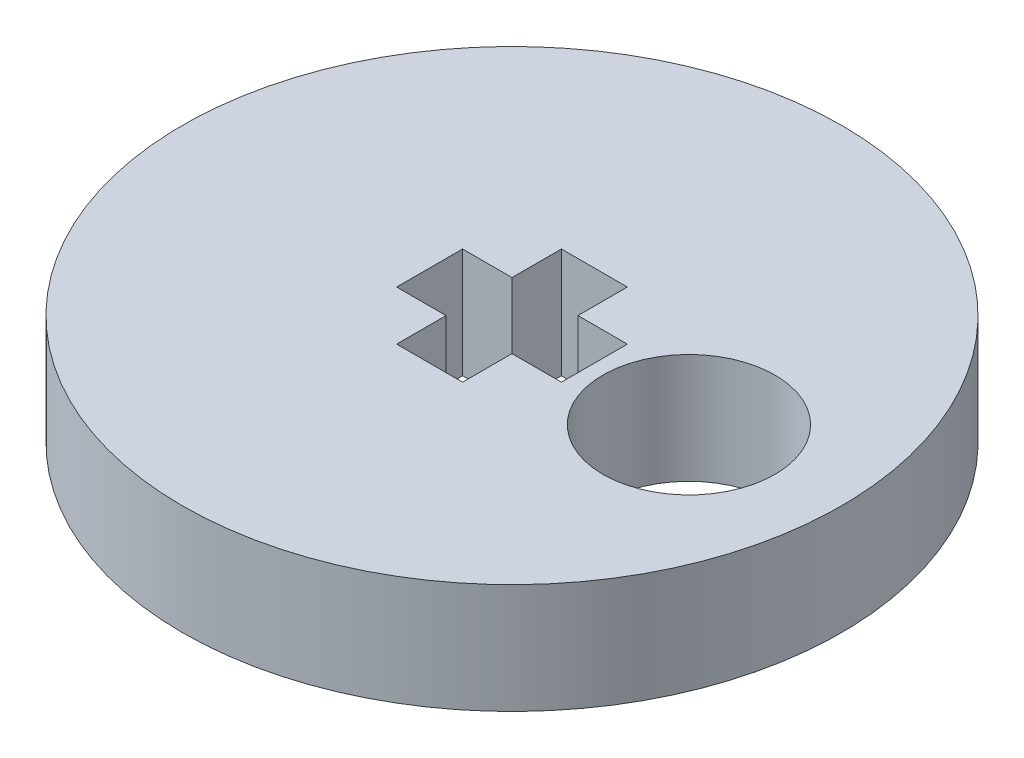
ISO-10303-21;
HEADER;
FILE_DESCRIPTION(('STEP AP214'),'2;1');
FILE_NAME('part.step','',(''),(''),'','','');
FILE_SCHEMA(('AUTOMOTIVE_DESIGN { 1 0 10303 214 1 1 1 1 }'));
ENDSEC;
DATA;
#1=APPLICATION_CONTEXT('core data for automotive mechanical design processes');
#2=APPLICATION_PROTOCOL_DEFINITION('international standard','automotive_design',2000,#1);
#3=PRODUCT_CONTEXT('',#1,'mechanical');
#4=PRODUCT('Part','Part','',(#3));
#5=PRODUCT_RELATED_PRODUCT_CATEGORY('part','',(#4));
#6=PRODUCT_DEFINITION_FORMATION('','',#4);
#7=PRODUCT_DEFINITION_CONTEXT('part definition',#1,'design');
#8=PRODUCT_DEFINITION('design','',#6,#7);
#9=PRODUCT_DEFINITION_SHAPE('','',#8);
#10=(LENGTH_UNIT() NAMED_UNIT(*) SI_UNIT(.MILLI.,.METRE.));
#11=(NAMED_UNIT(*) PLANE_ANGLE_UNIT() SI_UNIT($,.RADIAN.));
#12=(NAMED_UNIT(*) SI_UNIT($,.STERADIAN.) SOLID_ANGLE_UNIT());
#13=UNCERTAINTY_MEASURE_WITH_UNIT(LENGTH_MEASURE(1.E-05),#10,'distance_accuracy_value','');
#14=(GEOMETRIC_REPRESENTATION_CONTEXT(3) GLOBAL_UNCERTAINTY_ASSIGNED_CONTEXT((#13)) GLOBAL_UNIT_ASSIGNED_CONTEXT((#10,
#11,#12)) REPRESENTATION_CONTEXT('',''));
#15=CARTESIAN_POINT('',(0.,0.,0.));
#16=DIRECTION('',(0.,0.,1.));
#17=DIRECTION('',(1.,0.,0.));
#18=AXIS2_PLACEMENT_3D('',#15,#16,#17);
#19=CARTESIAN_POINT('',(0.,3.,0.));
#20=DIRECTION('',(0.,1.,0.));
#21=DIRECTION('',(0.,0.,1.));
#22=AXIS2_PLACEMENT_3D('',#19,#20,#21);
#23=PLANE('',#22);
#24=DIRECTION('',(0.,0.,1.));
#25=VECTOR('',#24,1.);
#26=CARTESIAN_POINT('',(-2.25,3.,-0.9));
#27=LINE('',#26,#25);
#28=CARTESIAN_POINT('',(-2.25,3.,-0.9));
#29=VERTEX_POINT('',#28);
#30=CARTESIAN_POINT('',(-2.25,3.,0.9));
#31=VERTEX_POINT('',#30);
#32=EDGE_CURVE('E144',#29,#31,#27,.T.);
#33=ORIENTED_EDGE('',*,*,#32,.F.);
#34=DIRECTION('',(-1.,0.,0.));
#35=VECTOR('',#34,1.);
#36=CARTESIAN_POINT('',(-0.9,3.,-0.9));
#37=LINE('',#36,#35);
#38=CARTESIAN_POINT('',(-0.9,3.,-0.9));
#39=VERTEX_POINT('',#38);
#40=EDGE_CURVE('E135',#39,#29,#37,.T.);
#41=ORIENTED_EDGE('',*,*,#40,.F.);
#42=DIRECTION('',(0.,0.,1.));
#43=VECTOR('',#42,1.);
#44=CARTESIAN_POINT('',(-0.900000000000001,3.,-2.25));
#45=LINE('',#44,#43);
#46=CARTESIAN_POINT('',(-0.900000000000001,3.,-2.25));
#47=VERTEX_POINT('',#46);
#48=EDGE_CURVE('E189',#47,#39,#45,.T.);
#49=ORIENTED_EDGE('',*,*,#48,.F.);
#50=DIRECTION('',(-1.,0.,0.));
#51=VECTOR('',#50,1.);
#52=CARTESIAN_POINT('',(0.9,3.,-2.25));
#53=LINE('',#52,#51);
#54=CARTESIAN_POINT('',(0.9,3.,-2.25));
#55=VERTEX_POINT('',#54);
#56=EDGE_CURVE('E186',#55,#47,#53,.T.);
#57=ORIENTED_EDGE('',*,*,#56,.F.);
#58=DIRECTION('',(0.,0.,-1.));
#59=VECTOR('',#58,1.);
#60=CARTESIAN_POINT('',(0.9,3.,-0.9));
#61=LINE('',#60,#59);
#62=CARTESIAN_POINT('',(0.9,3.,-0.9));
#63=VERTEX_POINT('',#62);
#64=EDGE_CURVE('E183',#63,#55,#61,.T.);
#65=ORIENTED_EDGE('',*,*,#64,.F.);
#66=DIRECTION('',(-1.,0.,0.));
#67=VECTOR('',#66,1.);
#68=CARTESIAN_POINT('',(2.25,3.,-0.9));
#69=LINE('',#68,#67);
#70=CARTESIAN_POINT('',(2.25,3.,-0.9));
#71=VERTEX_POINT('',#70);
#72=EDGE_CURVE('E180',#71,#63,#69,.T.);
#73=ORIENTED_EDGE('',*,*,#72,.F.);
#74=DIRECTION('',(0.,0.,-1.));
#75=VECTOR('',#74,1.);
#76=CARTESIAN_POINT('',(2.25,3.,0.9));
#77=LINE('',#76,#75);
#78=CARTESIAN_POINT('',(2.25,3.,0.9));
#79=VERTEX_POINT('',#78);
#80=EDGE_CURVE('E177',#79,#71,#77,.T.);
#81=ORIENTED_EDGE('',*,*,#80,.F.);
#82=DIRECTION('',(1.,0.,0.));
#83=VECTOR('',#82,1.);
#84=CARTESIAN_POINT('',(0.9,3.,0.9));
#85=LINE('',#84,#83);
#86=CARTESIAN_POINT('',(0.9,3.,0.9));
#87=VERTEX_POINT('',#86);
#88=EDGE_CURVE('E174',#87,#79,#85,.T.);
#89=ORIENTED_EDGE('',*,*,#88,.F.);
#90=DIRECTION('',(0.,0.,-1.));
#91=VECTOR('',#90,1.);
#92=CARTESIAN_POINT('',(0.9,3.,2.25));
#93=LINE('',#92,#91);
#94=CARTESIAN_POINT('',(0.9,3.,2.25));
#95=VERTEX_POINT('',#94);
#96=EDGE_CURVE('E171',#95,#87,#93,.T.);
#97=ORIENTED_EDGE('',*,*,#96,.F.);
#98=DIRECTION('',(1.,0.,0.));
#99=VECTOR('',#98,1.);
#100=CARTESIAN_POINT('',(-0.899999999999999,3.,2.25));
#101=LINE('',#100,#99);
#102=CARTESIAN_POINT('',(-0.899999999999999,3.,2.25));
#103=VERTEX_POINT('',#102);
#104=EDGE_CURVE('E168',#103,#95,#101,.T.);
#105=ORIENTED_EDGE('',*,*,#104,.F.);
#106=DIRECTION('',(0.,0.,1.));
#107=VECTOR('',#106,1.);
#108=CARTESIAN_POINT('',(-0.9,3.,0.9));
#109=LINE('',#108,#107);
#110=CARTESIAN_POINT('',(-0.9,3.,0.9));
#111=VERTEX_POINT('',#110);
#112=EDGE_CURVE('E162',#111,#103,#109,.T.);
#113=ORIENTED_EDGE('',*,*,#112,.F.);
#114=DIRECTION('',(1.,0.,0.));
#115=VECTOR('',#114,1.);
#116=CARTESIAN_POINT('',(-2.25,3.,0.9));
#117=LINE('',#116,#115);
#118=EDGE_CURVE('E158',#31,#111,#117,.T.);
#119=ORIENTED_EDGE('',*,*,#118,.F.);
#120=EDGE_LOOP('',(#33,#41,#49,#57,#65,#73,#81,#89,#97,#105,#113,#119));
#121=FACE_BOUND('',#120,.T.);
#122=CARTESIAN_POINT('',(0.,3.,0.));
#123=DIRECTION('',(0.,1.,0.));
#124=DIRECTION('',(0.,0.,1.));
#125=AXIS2_PLACEMENT_3D('',#122,#123,#124);
#126=CIRCLE('',#125,9.);
#127=CARTESIAN_POINT('',(0.,3.,9.));
#128=VERTEX_POINT('',#127);
#129=EDGE_CURVE('E11',#128,#128,#126,.T.);
#130=ORIENTED_EDGE('',*,*,#129,.T.);
#131=EDGE_LOOP('',(#130));
#132=FACE_BOUND('',#131,.T.);
#133=CARTESIAN_POINT('',(4.99728198946741,3.,0.16484149278824));
#134=DIRECTION('',(0.,1.,0.));
#135=DIRECTION('',(0.,0.,1.));
#136=AXIS2_PLACEMENT_3D('',#133,#134,#135);
#137=CIRCLE('',#136,2.35);
#138=CARTESIAN_POINT('',(4.99728198946741,3.,2.51484149278824));
#139=VERTEX_POINT('',#138);
#140=EDGE_CURVE('E194',#139,#139,#137,.T.);
#141=ORIENTED_EDGE('',*,*,#140,.F.);
#142=EDGE_LOOP('',(#141));
#143=FACE_BOUND('',#142,.T.);
#144=ADVANCED_FACE('F45',(#121,#132,#143),#23,.T.);
#145=CARTESIAN_POINT('',(0.,0.,0.));
#146=DIRECTION('',(0.,1.,0.));
#147=DIRECTION('',(0.,0.,1.));
#148=AXIS2_PLACEMENT_3D('',#145,#146,#147);
#149=PLANE('',#148);
#150=CARTESIAN_POINT('',(0.,0.,0.));
#151=DIRECTION('',(0.,1.,0.));
#152=DIRECTION('',(0.,0.,1.));
#153=AXIS2_PLACEMENT_3D('',#150,#151,#152);
#154=CIRCLE('',#153,9.);
#155=CARTESIAN_POINT('',(0.,0.,9.));
#156=VERTEX_POINT('',#155);
#157=EDGE_CURVE('E49',#156,#156,#154,.T.);
#158=ORIENTED_EDGE('',*,*,#157,.F.);
#159=EDGE_LOOP('',(#158));
#160=FACE_BOUND('',#159,.T.);
#161=DIRECTION('',(-1.,0.,0.));
#162=VECTOR('',#161,1.);
#163=CARTESIAN_POINT('',(-0.9,0.,-0.9));
#164=LINE('',#163,#162);
#165=CARTESIAN_POINT('',(-0.9,0.,-0.9));
#166=VERTEX_POINT('',#165);
#167=CARTESIAN_POINT('',(-2.25,0.,-0.9));
#168=VERTEX_POINT('',#167);
#169=EDGE_CURVE('E69',#166,#168,#164,.T.);
#170=ORIENTED_EDGE('',*,*,#169,.T.);
#171=DIRECTION('',(0.,0.,1.));
#172=VECTOR('',#171,1.);
#173=CARTESIAN_POINT('',(-2.25,0.,-0.9));
#174=LINE('',#173,#172);
#175=CARTESIAN_POINT('',(-2.25,0.,0.9));
#176=VERTEX_POINT('',#175);
#177=EDGE_CURVE('E151',#168,#176,#174,.T.);
#178=ORIENTED_EDGE('',*,*,#177,.T.);
#179=DIRECTION('',(1.,0.,0.));
#180=VECTOR('',#179,1.);
#181=CARTESIAN_POINT('',(-2.25,0.,0.9));
#182=LINE('',#181,#180);
#183=CARTESIAN_POINT('',(-0.9,0.,0.9));
#184=VERTEX_POINT('',#183);
#185=EDGE_CURVE('E197',#176,#184,#182,.T.);
#186=ORIENTED_EDGE('',*,*,#185,.T.);
#187=DIRECTION('',(0.,0.,1.));
#188=VECTOR('',#187,1.);
#189=CARTESIAN_POINT('',(-0.9,0.,0.9));
#190=LINE('',#189,#188);
#191=CARTESIAN_POINT('',(-0.899999999999999,0.,2.25));
#192=VERTEX_POINT('',#191);
#193=EDGE_CURVE('E201',#184,#192,#190,.T.);
#194=ORIENTED_EDGE('',*,*,#193,.T.);
#195=DIRECTION('',(1.,0.,0.));
#196=VECTOR('',#195,1.);
#197=CARTESIAN_POINT('',(-0.899999999999999,0.,2.25));
#198=LINE('',#197,#196);
#199=CARTESIAN_POINT('',(0.9,0.,2.25));
#200=VERTEX_POINT('',#199);
#201=EDGE_CURVE('E205',#192,#200,#198,.T.);
#202=ORIENTED_EDGE('',*,*,#201,.T.);
#203=DIRECTION('',(0.,0.,-1.));
#204=VECTOR('',#203,1.);
#205=CARTESIAN_POINT('',(0.9,0.,2.25));
#206=LINE('',#205,#204);
#207=CARTESIAN_POINT('',(0.9,0.,0.9));
#208=VERTEX_POINT('',#207);
#209=EDGE_CURVE('E209',#200,#208,#206,.T.);
#210=ORIENTED_EDGE('',*,*,#209,.T.);
#211=DIRECTION('',(1.,0.,0.));
#212=VECTOR('',#211,1.);
#213=CARTESIAN_POINT('',(0.9,0.,0.9));
#214=LINE('',#213,#212);
#215=CARTESIAN_POINT('',(2.25,0.,0.9));
#216=VERTEX_POINT('',#215);
#217=EDGE_CURVE('E213',#208,#216,#214,.T.);
#218=ORIENTED_EDGE('',*,*,#217,.T.);
#219=DIRECTION('',(0.,0.,-1.));
#220=VECTOR('',#219,1.);
#221=CARTESIAN_POINT('',(2.25,0.,0.9));
#222=LINE('',#221,#220);
#223=CARTESIAN_POINT('',(2.25,0.,-0.9));
#224=VERTEX_POINT('',#223);
#225=EDGE_CURVE('E217',#216,#224,#222,.T.);
#226=ORIENTED_EDGE('',*,*,#225,.T.);
#227=DIRECTION('',(-1.,0.,0.));
#228=VECTOR('',#227,1.);
#229=CARTESIAN_POINT('',(2.25,0.,-0.9));
#230=LINE('',#229,#228);
#231=CARTESIAN_POINT('',(0.9,0.,-0.9));
#232=VERTEX_POINT('',#231);
#233=EDGE_CURVE('E221',#224,#232,#230,.T.);
#234=ORIENTED_EDGE('',*,*,#233,.T.);
#235=DIRECTION('',(0.,0.,-1.));
#236=VECTOR('',#235,1.);
#237=CARTESIAN_POINT('',(0.9,0.,-0.9));
#238=LINE('',#237,#236);
#239=CARTESIAN_POINT('',(0.9,0.,-2.25));
#240=VERTEX_POINT('',#239);
#241=EDGE_CURVE('E225',#232,#240,#238,.T.);
#242=ORIENTED_EDGE('',*,*,#241,.T.);
#243=DIRECTION('',(-1.,0.,0.));
#244=VECTOR('',#243,1.);
#245=CARTESIAN_POINT('',(0.9,0.,-2.25));
#246=LINE('',#245,#244);
#247=CARTESIAN_POINT('',(-0.900000000000001,0.,-2.25));
#248=VERTEX_POINT('',#247);
#249=EDGE_CURVE('E229',#240,#248,#246,.T.);
#250=ORIENTED_EDGE('',*,*,#249,.T.);
#251=DIRECTION('',(0.,0.,1.));
#252=VECTOR('',#251,1.);
#253=CARTESIAN_POINT('',(-0.900000000000001,0.,-2.25));
#254=LINE('',#253,#252);
#255=EDGE_CURVE('E145',#248,#166,#254,.T.);
#256=ORIENTED_EDGE('',*,*,#255,.T.);
#257=EDGE_LOOP('',(#170,#178,#186,#194,#202,#210,#218,#226,#234,#242,#250,#256));
#258=FACE_BOUND('',#257,.T.);
#259=CARTESIAN_POINT('',(4.99728198946741,0.,0.16484149278824));
#260=DIRECTION('',(0.,1.,0.));
#261=DIRECTION('',(0.,0.,1.));
#262=AXIS2_PLACEMENT_3D('',#259,#260,#261);
#263=CIRCLE('',#262,2.35);
#264=CARTESIAN_POINT('',(4.99728198946741,0.,2.51484149278824));
#265=VERTEX_POINT('',#264);
#266=EDGE_CURVE('E424',#265,#265,#263,.T.);
#267=ORIENTED_EDGE('',*,*,#266,.T.);
#268=EDGE_LOOP('',(#267));
#269=FACE_BOUND('',#268,.T.);
#270=ADVANCED_FACE('F271',(#160,#258,#269),#149,.F.);
#271=CARTESIAN_POINT('',(0.,3.,0.));
#272=DIRECTION('',(0.,-1.,0.));
#273=DIRECTION('',(0.,0.,-1.));
#274=AXIS2_PLACEMENT_3D('',#271,#272,#273);
#275=CYLINDRICAL_SURFACE('',#274,9.);
#276=ORIENTED_EDGE('',*,*,#129,.F.);
#277=EDGE_LOOP('',(#276));
#278=FACE_BOUND('',#277,.T.);
#279=ORIENTED_EDGE('',*,*,#157,.T.);
#280=EDGE_LOOP('',(#279));
#281=FACE_BOUND('',#280,.T.);
#282=ADVANCED_FACE('F47',(#278,#281),#275,.T.);
#283=CARTESIAN_POINT('',(-0.9,3.,-0.9));
#284=DIRECTION('',(0.,0.,1.));
#285=DIRECTION('',(1.,0.,0.));
#286=AXIS2_PLACEMENT_3D('',#283,#284,#285);
#287=PLANE('',#286);
#288=ORIENTED_EDGE('',*,*,#169,.F.);
#289=DIRECTION('',(0.,-1.,0.));
#290=VECTOR('',#289,1.);
#291=CARTESIAN_POINT('',(-0.9,3.,-0.9));
#292=LINE('',#291,#290);
#293=EDGE_CURVE('E139',#39,#166,#292,.T.);
#294=ORIENTED_EDGE('',*,*,#293,.F.);
#295=ORIENTED_EDGE('',*,*,#40,.T.);
#296=DIRECTION('',(0.,-1.,0.));
#297=VECTOR('',#296,1.);
#298=CARTESIAN_POINT('',(-2.25,3.,-0.9));
#299=LINE('',#298,#297);
#300=EDGE_CURVE('E138',#29,#168,#299,.T.);
#301=ORIENTED_EDGE('',*,*,#300,.T.);
#302=EDGE_LOOP('',(#288,#294,#295,#301));
#303=FACE_BOUND('',#302,.T.);
#304=ADVANCED_FACE('F137',(#303),#287,.T.);
#305=CARTESIAN_POINT('',(-2.25,3.,-0.9));
#306=DIRECTION('',(1.,0.,0.));
#307=DIRECTION('',(0.,0.,-1.));
#308=AXIS2_PLACEMENT_3D('',#305,#306,#307);
#309=PLANE('',#308);
#310=ORIENTED_EDGE('',*,*,#177,.F.);
#311=ORIENTED_EDGE('',*,*,#300,.F.);
#312=ORIENTED_EDGE('',*,*,#32,.T.);
#313=DIRECTION('',(0.,-1.,0.));
#314=VECTOR('',#313,1.);
#315=CARTESIAN_POINT('',(-2.25,3.,0.9));
#316=LINE('',#315,#314);
#317=EDGE_CURVE('E153',#31,#176,#316,.T.);
#318=ORIENTED_EDGE('',*,*,#317,.T.);
#319=EDGE_LOOP('',(#310,#311,#312,#318));
#320=FACE_BOUND('',#319,.T.);
#321=ADVANCED_FACE('F148',(#320),#309,.T.);
#322=CARTESIAN_POINT('',(-2.25,3.,0.9));
#323=DIRECTION('',(0.,0.,-1.));
#324=DIRECTION('',(-1.,0.,0.));
#325=AXIS2_PLACEMENT_3D('',#322,#323,#324);
#326=PLANE('',#325);
#327=ORIENTED_EDGE('',*,*,#185,.F.);
#328=ORIENTED_EDGE('',*,*,#317,.F.);
#329=ORIENTED_EDGE('',*,*,#118,.T.);
#330=DIRECTION('',(0.,-1.,0.));
#331=VECTOR('',#330,1.);
#332=CARTESIAN_POINT('',(-0.9,3.,0.9));
#333=LINE('',#332,#331);
#334=EDGE_CURVE('E261',#111,#184,#333,.T.);
#335=ORIENTED_EDGE('',*,*,#334,.T.);
#336=EDGE_LOOP('',(#327,#328,#329,#335));
#337=FACE_BOUND('',#336,.T.);
#338=ADVANCED_FACE('F267',(#337),#326,.T.);
#339=CARTESIAN_POINT('',(-0.9,3.,0.9));
#340=DIRECTION('',(1.,0.,0.));
#341=DIRECTION('',(0.,0.,-1.));
#342=AXIS2_PLACEMENT_3D('',#339,#340,#341);
#343=PLANE('',#342);
#344=ORIENTED_EDGE('',*,*,#193,.F.);
#345=ORIENTED_EDGE('',*,*,#334,.F.);
#346=ORIENTED_EDGE('',*,*,#112,.T.);
#347=DIRECTION('',(0.,-1.,0.));
#348=VECTOR('',#347,1.);
#349=CARTESIAN_POINT('',(-0.899999999999999,3.,2.25));
#350=LINE('',#349,#348);
#351=EDGE_CURVE('E258',#103,#192,#350,.T.);
#352=ORIENTED_EDGE('',*,*,#351,.T.);
#353=EDGE_LOOP('',(#344,#345,#346,#352));
#354=FACE_BOUND('',#353,.T.);
#355=ADVANCED_FACE('F310',(#354),#343,.T.);
#356=CARTESIAN_POINT('',(-0.899999999999999,3.,2.25));
#357=DIRECTION('',(0.,0.,-1.));
#358=DIRECTION('',(-1.,0.,0.));
#359=AXIS2_PLACEMENT_3D('',#356,#357,#358);
#360=PLANE('',#359);
#361=ORIENTED_EDGE('',*,*,#201,.F.);
#362=ORIENTED_EDGE('',*,*,#351,.F.);
#363=ORIENTED_EDGE('',*,*,#104,.T.);
#364=DIRECTION('',(0.,-1.,0.));
#365=VECTOR('',#364,1.);
#366=CARTESIAN_POINT('',(0.9,3.,2.25));
#367=LINE('',#366,#365);
#368=EDGE_CURVE('E255',#95,#200,#367,.T.);
#369=ORIENTED_EDGE('',*,*,#368,.T.);
#370=EDGE_LOOP('',(#361,#362,#363,#369));
#371=FACE_BOUND('',#370,.T.);
#372=ADVANCED_FACE('F308',(#371),#360,.T.);
#373=CARTESIAN_POINT('',(0.9,3.,2.25));
#374=DIRECTION('',(-1.,0.,0.));
#375=DIRECTION('',(0.,0.,1.));
#376=AXIS2_PLACEMENT_3D('',#373,#374,#375);
#377=PLANE('',#376);
#378=ORIENTED_EDGE('',*,*,#209,.F.);
#379=ORIENTED_EDGE('',*,*,#368,.F.);
#380=ORIENTED_EDGE('',*,*,#96,.T.);
#381=DIRECTION('',(0.,-1.,0.));
#382=VECTOR('',#381,1.);
#383=CARTESIAN_POINT('',(0.9,3.,0.9));
#384=LINE('',#383,#382);
#385=EDGE_CURVE('E252',#87,#208,#384,.T.);
#386=ORIENTED_EDGE('',*,*,#385,.T.);
#387=EDGE_LOOP('',(#378,#379,#380,#386));
#388=FACE_BOUND('',#387,.T.);
#389=ADVANCED_FACE('F302',(#388),#377,.T.);
#390=CARTESIAN_POINT('',(0.9,3.,0.9));
#391=DIRECTION('',(0.,0.,-1.));
#392=DIRECTION('',(-1.,0.,0.));
#393=AXIS2_PLACEMENT_3D('',#390,#391,#392);
#394=PLANE('',#393);
#395=ORIENTED_EDGE('',*,*,#217,.F.);
#396=ORIENTED_EDGE('',*,*,#385,.F.);
#397=ORIENTED_EDGE('',*,*,#88,.T.);
#398=DIRECTION('',(0.,-1.,0.));
#399=VECTOR('',#398,1.);
#400=CARTESIAN_POINT('',(2.25,3.,0.9));
#401=LINE('',#400,#399);
#402=EDGE_CURVE('E249',#79,#216,#401,.T.);
#403=ORIENTED_EDGE('',*,*,#402,.T.);
#404=EDGE_LOOP('',(#395,#396,#397,#403));
#405=FACE_BOUND('',#404,.T.);
#406=ADVANCED_FACE('F298',(#405),#394,.T.);
#407=CARTESIAN_POINT('',(2.25,3.,0.9));
#408=DIRECTION('',(-1.,0.,0.));
#409=DIRECTION('',(0.,0.,1.));
#410=AXIS2_PLACEMENT_3D('',#407,#408,#409);
#411=PLANE('',#410);
#412=ORIENTED_EDGE('',*,*,#225,.F.);
#413=ORIENTED_EDGE('',*,*,#402,.F.);
#414=ORIENTED_EDGE('',*,*,#80,.T.);
#415=DIRECTION('',(0.,-1.,0.));
#416=VECTOR('',#415,1.);
#417=CARTESIAN_POINT('',(2.25,3.,-0.9));
#418=LINE('',#417,#416);
#419=EDGE_CURVE('E246',#71,#224,#418,.T.);
#420=ORIENTED_EDGE('',*,*,#419,.T.);
#421=EDGE_LOOP('',(#412,#413,#414,#420));
#422=FACE_BOUND('',#421,.T.);
#423=ADVANCED_FACE('F295',(#422),#411,.T.);
#424=CARTESIAN_POINT('',(2.25,3.,-0.9));
#425=DIRECTION('',(0.,0.,1.));
#426=DIRECTION('',(1.,0.,0.));
#427=AXIS2_PLACEMENT_3D('',#424,#425,#426);
#428=PLANE('',#427);
#429=ORIENTED_EDGE('',*,*,#233,.F.);
#430=ORIENTED_EDGE('',*,*,#419,.F.);
#431=ORIENTED_EDGE('',*,*,#72,.T.);
#432=DIRECTION('',(0.,-1.,0.));
#433=VECTOR('',#432,1.);
#434=CARTESIAN_POINT('',(0.9,3.,-0.9));
#435=LINE('',#434,#433);
#436=EDGE_CURVE('E243',#63,#232,#435,.T.);
#437=ORIENTED_EDGE('',*,*,#436,.T.);
#438=EDGE_LOOP('',(#429,#430,#431,#437));
#439=FACE_BOUND('',#438,.T.);
#440=ADVANCED_FACE('F287',(#439),#428,.T.);
#441=CARTESIAN_POINT('',(0.9,3.,-0.9));
#442=DIRECTION('',(-1.,0.,0.));
#443=DIRECTION('',(0.,0.,1.));
#444=AXIS2_PLACEMENT_3D('',#441,#442,#443);
#445=PLANE('',#444);
#446=ORIENTED_EDGE('',*,*,#241,.F.);
#447=ORIENTED_EDGE('',*,*,#436,.F.);
#448=ORIENTED_EDGE('',*,*,#64,.T.);
#449=DIRECTION('',(0.,-1.,0.));
#450=VECTOR('',#449,1.);
#451=CARTESIAN_POINT('',(0.9,3.,-2.25));
#452=LINE('',#451,#450);
#453=EDGE_CURVE('E240',#55,#240,#452,.T.);
#454=ORIENTED_EDGE('',*,*,#453,.T.);
#455=EDGE_LOOP('',(#446,#447,#448,#454));
#456=FACE_BOUND('',#455,.T.);
#457=ADVANCED_FACE('F283',(#456),#445,.T.);
#458=CARTESIAN_POINT('',(0.9,3.,-2.25));
#459=DIRECTION('',(0.,0.,1.));
#460=DIRECTION('',(1.,0.,0.));
#461=AXIS2_PLACEMENT_3D('',#458,#459,#460);
#462=PLANE('',#461);
#463=ORIENTED_EDGE('',*,*,#249,.F.);
#464=ORIENTED_EDGE('',*,*,#453,.F.);
#465=ORIENTED_EDGE('',*,*,#56,.T.);
#466=DIRECTION('',(0.,-1.,0.));
#467=VECTOR('',#466,1.);
#468=CARTESIAN_POINT('',(-0.900000000000001,3.,-2.25));
#469=LINE('',#468,#467);
#470=EDGE_CURVE('E61',#47,#248,#469,.T.);
#471=ORIENTED_EDGE('',*,*,#470,.T.);
#472=EDGE_LOOP('',(#463,#464,#465,#471));
#473=FACE_BOUND('',#472,.T.);
#474=ADVANCED_FACE('F280',(#473),#462,.T.);
#475=CARTESIAN_POINT('',(-0.900000000000001,3.,-2.25));
#476=DIRECTION('',(1.,0.,0.));
#477=DIRECTION('',(0.,0.,-1.));
#478=AXIS2_PLACEMENT_3D('',#475,#476,#477);
#479=PLANE('',#478);
#480=ORIENTED_EDGE('',*,*,#255,.F.);
#481=ORIENTED_EDGE('',*,*,#470,.F.);
#482=ORIENTED_EDGE('',*,*,#48,.T.);
#483=ORIENTED_EDGE('',*,*,#293,.T.);
#484=EDGE_LOOP('',(#480,#481,#482,#483));
#485=FACE_BOUND('',#484,.T.);
#486=ADVANCED_FACE('F274',(#485),#479,.T.);
#487=CARTESIAN_POINT('',(4.99728198946741,3.,0.16484149278824));
#488=DIRECTION('',(0.,-1.,0.));
#489=DIRECTION('',(0.,0.,-1.));
#490=AXIS2_PLACEMENT_3D('',#487,#488,#489);
#491=CYLINDRICAL_SURFACE('',#490,2.35);
#492=ORIENTED_EDGE('',*,*,#140,.T.);
#493=EDGE_LOOP('',(#492));
#494=FACE_BOUND('',#493,.T.);
#495=ORIENTED_EDGE('',*,*,#266,.F.);
#496=EDGE_LOOP('',(#495));
#497=FACE_BOUND('',#496,.T.);
#498=ADVANCED_FACE('F407',(#494,#497),#491,.F.);
#499=CLOSED_SHELL('',(#144,#270,#282,#304,#321,#338,#355,#372,#389,#406,#423,#440,#457,#474,
#486,#498));
#500=MANIFOLD_SOLID_BREP('B2',#499);
#501=ADVANCED_BREP_SHAPE_REPRESENTATION('',(#18,#500),#14);
#502=SHAPE_DEFINITION_REPRESENTATION(#9,#501);
ENDSEC;
END-ISO-10303-21;
